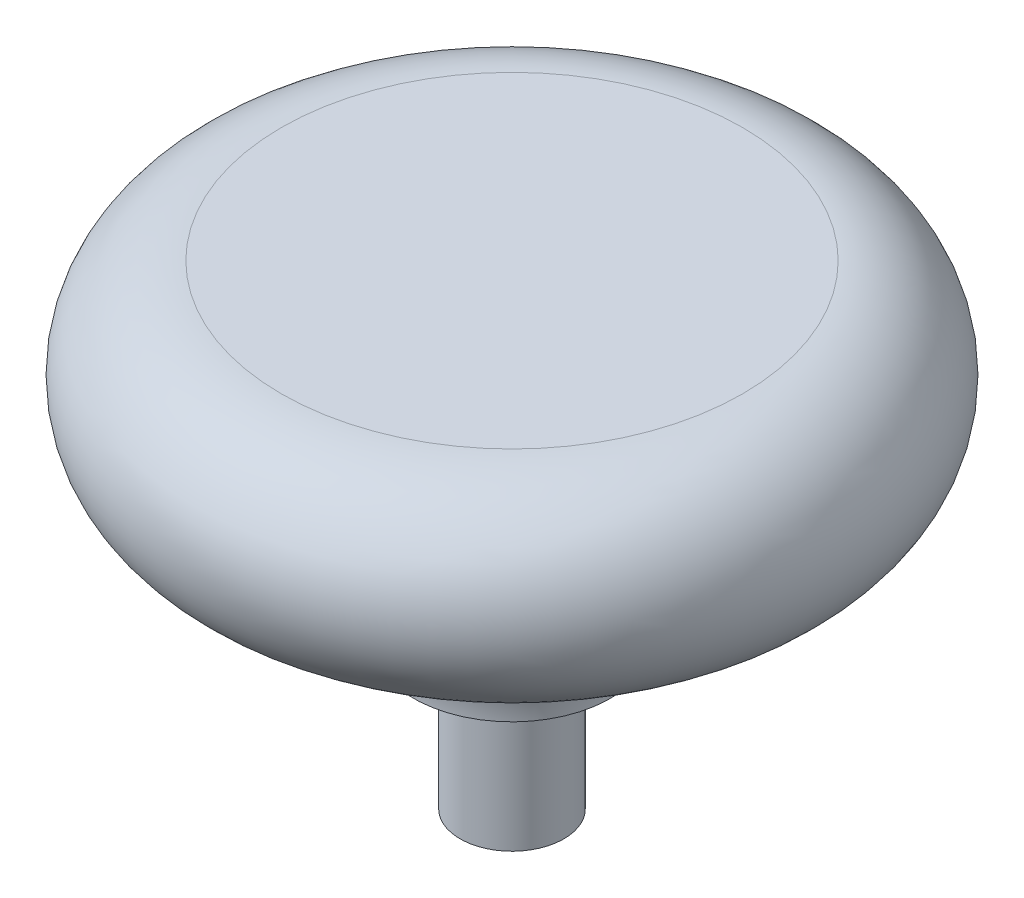
ISO-10303-21;
HEADER;
FILE_DESCRIPTION(('STEP AP214'),'2;1');
FILE_NAME('part.step','',(''),(''),'','','');
FILE_SCHEMA(('AUTOMOTIVE_DESIGN { 1 0 10303 214 1 1 1 1 }'));
ENDSEC;
DATA;
#1=APPLICATION_CONTEXT('core data for automotive mechanical design processes');
#2=APPLICATION_PROTOCOL_DEFINITION('international standard','automotive_design',2000,#1);
#3=PRODUCT_CONTEXT('',#1,'mechanical');
#4=PRODUCT('Part','Part','',(#3));
#5=PRODUCT_RELATED_PRODUCT_CATEGORY('part','',(#4));
#6=PRODUCT_DEFINITION_FORMATION('','',#4);
#7=PRODUCT_DEFINITION_CONTEXT('part definition',#1,'design');
#8=PRODUCT_DEFINITION('design','',#6,#7);
#9=PRODUCT_DEFINITION_SHAPE('','',#8);
#10=(LENGTH_UNIT() NAMED_UNIT(*) SI_UNIT(.MILLI.,.METRE.));
#11=(NAMED_UNIT(*) PLANE_ANGLE_UNIT() SI_UNIT($,.RADIAN.));
#12=(NAMED_UNIT(*) SI_UNIT($,.STERADIAN.) SOLID_ANGLE_UNIT());
#13=UNCERTAINTY_MEASURE_WITH_UNIT(LENGTH_MEASURE(1.E-05),#10,'distance_accuracy_value','');
#14=(GEOMETRIC_REPRESENTATION_CONTEXT(3) GLOBAL_UNCERTAINTY_ASSIGNED_CONTEXT((#13)) GLOBAL_UNIT_ASSIGNED_CONTEXT((#10,
#11,#12)) REPRESENTATION_CONTEXT('',''));
#15=CARTESIAN_POINT('',(0.,0.,0.));
#16=DIRECTION('',(0.,0.,1.));
#17=DIRECTION('',(1.,0.,0.));
#18=AXIS2_PLACEMENT_3D('',#15,#16,#17);
#19=CARTESIAN_POINT('',(2.5,0.,0.));
#20=DIRECTION('',(0.,1.,0.));
#21=DIRECTION('',(0.,0.,1.));
#22=AXIS2_PLACEMENT_3D('',#19,#20,#21);
#23=PLANE('',#22);
#24=CARTESIAN_POINT('',(0.,0.,0.));
#25=DIRECTION('',(0.,-1.,0.));
#26=DIRECTION('',(0.,0.,-1.));
#27=AXIS2_PLACEMENT_3D('',#24,#25,#26);
#28=CIRCLE('',#27,2.5);
#29=CARTESIAN_POINT('',(0.,0.,-2.5));
#30=VERTEX_POINT('',#29);
#31=EDGE_CURVE('E56',#30,#30,#28,.T.);
#32=ORIENTED_EDGE('',*,*,#31,.T.);
#33=EDGE_LOOP('',(#32));
#34=FACE_BOUND('',#33,.T.);
#35=ADVANCED_FACE('F37',(#34),#23,.F.);
#36=CARTESIAN_POINT('',(0.,22.875,0.));
#37=DIRECTION('',(0.,-1.,0.));
#38=DIRECTION('',(0.,0.,-1.));
#39=AXIS2_PLACEMENT_3D('',#36,#37,#38);
#40=PLANE('',#39);
#41=CARTESIAN_POINT('',(0.,22.875,0.));
#42=DIRECTION('',(0.,-1.,0.));
#43=DIRECTION('',(0.,0.,-1.));
#44=AXIS2_PLACEMENT_3D('',#41,#42,#43);
#45=CIRCLE('',#44,11.1125);
#46=CARTESIAN_POINT('',(0.,22.875,-11.1125));
#47=VERTEX_POINT('',#46);
#48=EDGE_CURVE('E10',#47,#47,#45,.T.);
#49=ORIENTED_EDGE('',*,*,#48,.F.);
#50=EDGE_LOOP('',(#49));
#51=FACE_BOUND('',#50,.T.);
#52=ADVANCED_FACE('F80',(#51),#40,.F.);
#53=CARTESIAN_POINT('',(0.,18.1125,0.));
#54=DIRECTION('',(0.,-1.,0.));
#55=DIRECTION('',(0.,0.,-1.));
#56=AXIS2_PLACEMENT_3D('',#53,#54,#55);
#57=TOROIDAL_SURFACE('',#56,11.1125,4.7625);
#58=CARTESIAN_POINT('',(0.,13.35,0.));
#59=DIRECTION('',(0.,-1.,0.));
#60=DIRECTION('',(0.,0.,-1.));
#61=AXIS2_PLACEMENT_3D('',#58,#59,#60);
#62=CIRCLE('',#61,11.1125);
#63=CARTESIAN_POINT('',(0.,13.35,-11.1125));
#64=VERTEX_POINT('',#63);
#65=EDGE_CURVE('E43',#64,#64,#62,.T.);
#66=ORIENTED_EDGE('',*,*,#65,.F.);
#67=EDGE_LOOP('',(#66));
#68=FACE_BOUND('',#67,.T.);
#69=ORIENTED_EDGE('',*,*,#48,.T.);
#70=EDGE_LOOP('',(#69));
#71=FACE_BOUND('',#70,.T.);
#72=ADVANCED_FACE('F75',(#68,#71),#57,.T.);
#73=CARTESIAN_POINT('',(0.,7.,0.));
#74=DIRECTION('',(0.,-1.,0.));
#75=DIRECTION('',(0.,0.,-1.));
#76=AXIS2_PLACEMENT_3D('',#73,#74,#75);
#77=TOROIDAL_SURFACE('',#76,11.1125,6.35);
#78=CARTESIAN_POINT('',(0.,7.,0.));
#79=DIRECTION('',(0.,-1.,0.));
#80=DIRECTION('',(0.,0.,-1.));
#81=AXIS2_PLACEMENT_3D('',#78,#79,#80);
#82=CIRCLE('',#81,4.7625);
#83=CARTESIAN_POINT('',(0.,7.,-4.7625));
#84=VERTEX_POINT('',#83);
#85=EDGE_CURVE('E47',#84,#84,#82,.T.);
#86=ORIENTED_EDGE('',*,*,#85,.F.);
#87=EDGE_LOOP('',(#86));
#88=FACE_BOUND('',#87,.T.);
#89=ORIENTED_EDGE('',*,*,#65,.T.);
#90=EDGE_LOOP('',(#89));
#91=FACE_BOUND('',#90,.T.);
#92=ADVANCED_FACE('F70',(#88,#91),#77,.F.);
#93=CARTESIAN_POINT('',(4.7625,7.,0.));
#94=DIRECTION('',(0.,1.,0.));
#95=DIRECTION('',(0.,0.,1.));
#96=AXIS2_PLACEMENT_3D('',#93,#94,#95);
#97=PLANE('',#96);
#98=CARTESIAN_POINT('',(0.,7.,0.));
#99=DIRECTION('',(0.,-1.,0.));
#100=DIRECTION('',(0.,0.,-1.));
#101=AXIS2_PLACEMENT_3D('',#98,#99,#100);
#102=CIRCLE('',#101,2.5);
#103=CARTESIAN_POINT('',(0.,7.,-2.5));
#104=VERTEX_POINT('',#103);
#105=EDGE_CURVE('E51',#104,#104,#102,.T.);
#106=ORIENTED_EDGE('',*,*,#105,.F.);
#107=EDGE_LOOP('',(#106));
#108=FACE_BOUND('',#107,.T.);
#109=ORIENTED_EDGE('',*,*,#85,.T.);
#110=EDGE_LOOP('',(#109));
#111=FACE_BOUND('',#110,.T.);
#112=ADVANCED_FACE('F64',(#108,#111),#97,.F.);
#113=CARTESIAN_POINT('',(0.,0.,0.));
#114=DIRECTION('',(0.,-1.,0.));
#115=DIRECTION('',(0.,0.,-1.));
#116=AXIS2_PLACEMENT_3D('',#113,#114,#115);
#117=CYLINDRICAL_SURFACE('',#116,2.5);
#118=ORIENTED_EDGE('',*,*,#31,.F.);
#119=EDGE_LOOP('',(#118));
#120=FACE_BOUND('',#119,.T.);
#121=ORIENTED_EDGE('',*,*,#105,.T.);
#122=EDGE_LOOP('',(#121));
#123=FACE_BOUND('',#122,.T.);
#124=ADVANCED_FACE('F61',(#120,#123),#117,.T.);
#125=CLOSED_SHELL('',(#35,#52,#72,#92,#112,#124));
#126=MANIFOLD_SOLID_BREP('B2',#125);
#127=ADVANCED_BREP_SHAPE_REPRESENTATION('',(#18,#126),#14);
#128=SHAPE_DEFINITION_REPRESENTATION(#9,#127);
ENDSEC;
END-ISO-10303-21;
